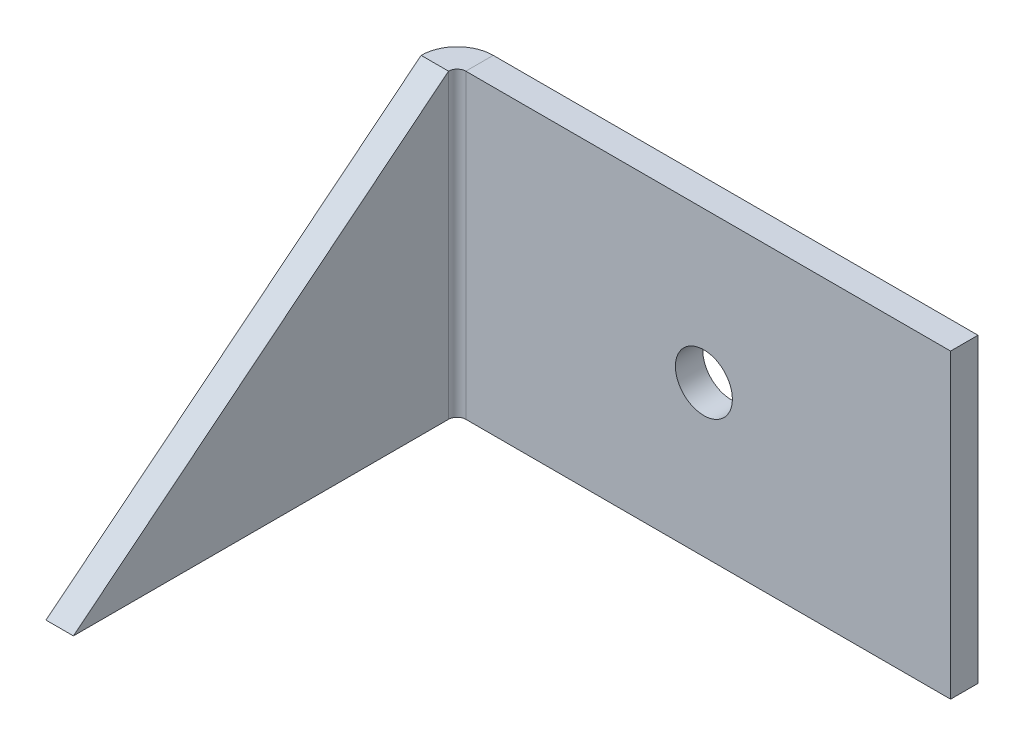
ISO-10303-21;
HEADER;
FILE_DESCRIPTION(('STEP AP214'),'2;1');
FILE_NAME('part.step','',(''),(''),'','','');
FILE_SCHEMA(('AUTOMOTIVE_DESIGN { 1 0 10303 214 1 1 1 1 }'));
ENDSEC;
DATA;
#1=APPLICATION_CONTEXT('core data for automotive mechanical design processes');
#2=APPLICATION_PROTOCOL_DEFINITION('international standard','automotive_design',2000,#1);
#3=PRODUCT_CONTEXT('',#1,'mechanical');
#4=PRODUCT('Part','Part','',(#3));
#5=PRODUCT_RELATED_PRODUCT_CATEGORY('part','',(#4));
#6=PRODUCT_DEFINITION_FORMATION('','',#4);
#7=PRODUCT_DEFINITION_CONTEXT('part definition',#1,'design');
#8=PRODUCT_DEFINITION('design','',#6,#7);
#9=PRODUCT_DEFINITION_SHAPE('','',#8);
#10=(LENGTH_UNIT() NAMED_UNIT(*) SI_UNIT(.MILLI.,.METRE.));
#11=(NAMED_UNIT(*) PLANE_ANGLE_UNIT() SI_UNIT($,.RADIAN.));
#12=(NAMED_UNIT(*) SI_UNIT($,.STERADIAN.) SOLID_ANGLE_UNIT());
#13=UNCERTAINTY_MEASURE_WITH_UNIT(LENGTH_MEASURE(1.E-05),#10,'distance_accuracy_value','');
#14=(GEOMETRIC_REPRESENTATION_CONTEXT(3) GLOBAL_UNCERTAINTY_ASSIGNED_CONTEXT((#13)) GLOBAL_UNIT_ASSIGNED_CONTEXT((#10,
#11,#12)) REPRESENTATION_CONTEXT('',''));
#15=CARTESIAN_POINT('',(0.,0.,0.));
#16=DIRECTION('',(0.,0.,1.));
#17=DIRECTION('',(1.,0.,0.));
#18=AXIS2_PLACEMENT_3D('',#15,#16,#17);
#19=CARTESIAN_POINT('',(-28.575,17.4625,3.175));
#20=DIRECTION('',(0.,-1.,0.));
#21=DIRECTION('',(0.,0.,-1.));
#22=AXIS2_PLACEMENT_3D('',#19,#20,#21);
#23=PLANE('',#22);
#24=DIRECTION('',(0.,0.,-1.));
#25=VECTOR('',#24,1.);
#26=CARTESIAN_POINT('',(-27.575,17.4625,3.175));
#27=LINE('',#26,#25);
#28=CARTESIAN_POINT('',(-27.575,17.4625,3.175));
#29=VERTEX_POINT('',#28);
#30=CARTESIAN_POINT('',(-27.575,17.4625,0.));
#31=VERTEX_POINT('',#30);
#32=EDGE_CURVE('E63',#29,#31,#27,.T.);
#33=ORIENTED_EDGE('',*,*,#32,.F.);
#34=DIRECTION('',(-1.,0.,0.));
#35=VECTOR('',#34,1.);
#36=CARTESIAN_POINT('',(-28.575,17.4625,3.175));
#37=LINE('',#36,#35);
#38=CARTESIAN_POINT('',(28.575,17.4625,3.175));
#39=VERTEX_POINT('',#38);
#40=EDGE_CURVE('E159',#39,#29,#37,.T.);
#41=ORIENTED_EDGE('',*,*,#40,.F.);
#42=DIRECTION('',(0.,0.,-1.));
#43=VECTOR('',#42,1.);
#44=CARTESIAN_POINT('',(28.575,17.4625,3.175));
#45=LINE('',#44,#43);
#46=CARTESIAN_POINT('',(28.575,17.4625,0.));
#47=VERTEX_POINT('',#46);
#48=EDGE_CURVE('E11',#39,#47,#45,.T.);
#49=ORIENTED_EDGE('',*,*,#48,.T.);
#50=DIRECTION('',(-1.,0.,0.));
#51=VECTOR('',#50,1.);
#52=CARTESIAN_POINT('',(-28.575,17.4625,0.));
#53=LINE('',#52,#51);
#54=EDGE_CURVE('E166',#47,#31,#53,.T.);
#55=ORIENTED_EDGE('',*,*,#54,.T.);
#56=EDGE_LOOP('',(#33,#41,#49,#55));
#57=FACE_BOUND('',#56,.T.);
#58=ADVANCED_FACE('F40',(#57),#23,.F.);
#59=CARTESIAN_POINT('',(-28.575,-17.4625,3.175));
#60=DIRECTION('',(0.,1.,0.));
#61=DIRECTION('',(0.,0.,1.));
#62=AXIS2_PLACEMENT_3D('',#59,#60,#61);
#63=PLANE('',#62);
#64=DIRECTION('',(0.,0.,-1.));
#65=VECTOR('',#64,1.);
#66=CARTESIAN_POINT('',(-27.575,-17.4625,3.175));
#67=LINE('',#66,#65);
#68=CARTESIAN_POINT('',(-27.575,-17.4625,3.175));
#69=VERTEX_POINT('',#68);
#70=CARTESIAN_POINT('',(-27.575,-17.4625,0.));
#71=VERTEX_POINT('',#70);
#72=EDGE_CURVE('E133',#69,#71,#67,.T.);
#73=ORIENTED_EDGE('',*,*,#72,.T.);
#74=DIRECTION('',(1.,0.,0.));
#75=VECTOR('',#74,1.);
#76=CARTESIAN_POINT('',(-28.575,-17.4625,0.));
#77=LINE('',#76,#75);
#78=CARTESIAN_POINT('',(28.575,-17.4625,0.));
#79=VERTEX_POINT('',#78);
#80=EDGE_CURVE('E160',#71,#79,#77,.T.);
#81=ORIENTED_EDGE('',*,*,#80,.T.);
#82=DIRECTION('',(0.,0.,-1.));
#83=VECTOR('',#82,1.);
#84=CARTESIAN_POINT('',(28.575,-17.4625,3.175));
#85=LINE('',#84,#83);
#86=CARTESIAN_POINT('',(28.575,-17.4625,3.175));
#87=VERTEX_POINT('',#86);
#88=EDGE_CURVE('E48',#87,#79,#85,.T.);
#89=ORIENTED_EDGE('',*,*,#88,.F.);
#90=DIRECTION('',(1.,0.,0.));
#91=VECTOR('',#90,1.);
#92=CARTESIAN_POINT('',(-28.575,-17.4625,3.175));
#93=LINE('',#92,#91);
#94=EDGE_CURVE('E162',#69,#87,#93,.T.);
#95=ORIENTED_EDGE('',*,*,#94,.F.);
#96=EDGE_LOOP('',(#73,#81,#89,#95));
#97=FACE_BOUND('',#96,.T.);
#98=ADVANCED_FACE('F180',(#97),#63,.F.);
#99=CARTESIAN_POINT('',(0.,0.,3.175));
#100=DIRECTION('',(0.,0.,1.));
#101=DIRECTION('',(1.,0.,0.));
#102=AXIS2_PLACEMENT_3D('',#99,#100,#101);
#103=PLANE('',#102);
#104=CARTESIAN_POINT('',(0.,0.,3.175));
#105=DIRECTION('',(0.,0.,1.));
#106=DIRECTION('',(1.,0.,0.));
#107=AXIS2_PLACEMENT_3D('',#104,#105,#106);
#108=CIRCLE('',#107,3.29999999999999);
#109=CARTESIAN_POINT('',(3.29999999999999,0.,3.175));
#110=VERTEX_POINT('',#109);
#111=EDGE_CURVE('E148',#110,#110,#108,.T.);
#112=ORIENTED_EDGE('',*,*,#111,.F.);
#113=EDGE_LOOP('',(#112));
#114=FACE_BOUND('',#113,.T.);
#115=ORIENTED_EDGE('',*,*,#40,.T.);
#116=DIRECTION('',(0.,-1.,0.));
#117=VECTOR('',#116,1.);
#118=CARTESIAN_POINT('',(-27.575,-17.4625,3.175));
#119=LINE('',#118,#117);
#120=EDGE_CURVE('E55',#69,#29,#119,.F.);
#121=ORIENTED_EDGE('',*,*,#120,.F.);
#122=ORIENTED_EDGE('',*,*,#94,.T.);
#123=DIRECTION('',(0.,1.,0.));
#124=VECTOR('',#123,1.);
#125=CARTESIAN_POINT('',(28.575,17.4625,3.175));
#126=LINE('',#125,#124);
#127=EDGE_CURVE('E156',#87,#39,#126,.T.);
#128=ORIENTED_EDGE('',*,*,#127,.T.);
#129=EDGE_LOOP('',(#115,#121,#122,#128));
#130=FACE_BOUND('',#129,.T.);
#131=ADVANCED_FACE('F178',(#114,#130),#103,.T.);
#132=CARTESIAN_POINT('',(0.,0.,0.));
#133=DIRECTION('',(0.,0.,1.));
#134=DIRECTION('',(1.,0.,0.));
#135=AXIS2_PLACEMENT_3D('',#132,#133,#134);
#136=PLANE('',#135);
#137=CARTESIAN_POINT('',(0.,0.,0.));
#138=DIRECTION('',(0.,0.,1.));
#139=DIRECTION('',(1.,0.,0.));
#140=AXIS2_PLACEMENT_3D('',#137,#138,#139);
#141=CIRCLE('',#140,3.3);
#142=CARTESIAN_POINT('',(3.3,0.,0.));
#143=VERTEX_POINT('',#142);
#144=EDGE_CURVE('E152',#143,#143,#141,.T.);
#145=ORIENTED_EDGE('',*,*,#144,.T.);
#146=EDGE_LOOP('',(#145));
#147=FACE_BOUND('',#146,.T.);
#148=DIRECTION('',(0.,-1.,0.));
#149=VECTOR('',#148,1.);
#150=CARTESIAN_POINT('',(-27.575,-17.4625,0.));
#151=LINE('',#150,#149);
#152=EDGE_CURVE('E134',#71,#31,#151,.F.);
#153=ORIENTED_EDGE('',*,*,#152,.T.);
#154=ORIENTED_EDGE('',*,*,#54,.F.);
#155=DIRECTION('',(0.,1.,0.));
#156=VECTOR('',#155,1.);
#157=CARTESIAN_POINT('',(28.575,17.4625,0.));
#158=LINE('',#157,#156);
#159=EDGE_CURVE('E155',#79,#47,#158,.T.);
#160=ORIENTED_EDGE('',*,*,#159,.F.);
#161=ORIENTED_EDGE('',*,*,#80,.F.);
#162=EDGE_LOOP('',(#153,#154,#160,#161));
#163=FACE_BOUND('',#162,.T.);
#164=ADVANCED_FACE('F177',(#147,#163),#136,.F.);
#165=CARTESIAN_POINT('',(28.575,17.4625,3.175));
#166=DIRECTION('',(-1.,0.,0.));
#167=DIRECTION('',(0.,-1.,0.));
#168=AXIS2_PLACEMENT_3D('',#165,#166,#167);
#169=PLANE('',#168);
#170=ORIENTED_EDGE('',*,*,#159,.T.);
#171=ORIENTED_EDGE('',*,*,#48,.F.);
#172=ORIENTED_EDGE('',*,*,#127,.F.);
#173=ORIENTED_EDGE('',*,*,#88,.T.);
#174=EDGE_LOOP('',(#170,#171,#172,#173));
#175=FACE_BOUND('',#174,.T.);
#176=ADVANCED_FACE('F42',(#175),#169,.F.);
#177=CARTESIAN_POINT('',(0.,0.,3.175));
#178=DIRECTION('',(0.,0.,1.));
#179=DIRECTION('',(1.,0.,0.));
#180=AXIS2_PLACEMENT_3D('',#177,#178,#179);
#181=CYLINDRICAL_SURFACE('',#180,3.29999999999999);
#182=ORIENTED_EDGE('',*,*,#144,.F.);
#183=EDGE_LOOP('',(#182));
#184=FACE_BOUND('',#183,.T.);
#185=ORIENTED_EDGE('',*,*,#111,.T.);
#186=EDGE_LOOP('',(#185));
#187=FACE_BOUND('',#186,.T.);
#188=ADVANCED_FACE('F221',(#184,#187),#181,.F.);
#189=CARTESIAN_POINT('',(-27.575,17.4625,4.17500000000001));
#190=DIRECTION('',(0.,1.,0.));
#191=DIRECTION('',(0.,0.,1.));
#192=AXIS2_PLACEMENT_3D('',#189,#190,#191);
#193=PLANE('',#192);
#194=DIRECTION('',(-1.,0.,0.));
#195=VECTOR('',#194,1.);
#196=CARTESIAN_POINT('',(-28.575,17.4625,4.175));
#197=LINE('',#196,#195);
#198=CARTESIAN_POINT('',(-28.5750000000001,17.4625,4.175));
#199=VERTEX_POINT('',#198);
#200=CARTESIAN_POINT('',(-31.75,17.4625,4.17499999999999));
#201=VERTEX_POINT('',#200);
#202=EDGE_CURVE('E99',#199,#201,#197,.T.);
#203=ORIENTED_EDGE('',*,*,#202,.F.);
#204=CARTESIAN_POINT('',(-27.575,17.4625,4.17500000000001));
#205=DIRECTION('',(0.,-1.,0.));
#206=DIRECTION('',(0.,0.,-1.));
#207=AXIS2_PLACEMENT_3D('',#204,#205,#206);
#208=CIRCLE('',#207,1.);
#209=EDGE_CURVE('E141',#29,#199,#208,.F.);
#210=ORIENTED_EDGE('',*,*,#209,.F.);
#211=ORIENTED_EDGE('',*,*,#32,.T.);
#212=CARTESIAN_POINT('',(-27.575,17.4625,4.17500000000001));
#213=DIRECTION('',(0.,-1.,0.));
#214=DIRECTION('',(0.,0.,-1.));
#215=AXIS2_PLACEMENT_3D('',#212,#213,#214);
#216=CIRCLE('',#215,4.175);
#217=EDGE_CURVE('E125',#31,#201,#216,.F.);
#218=ORIENTED_EDGE('',*,*,#217,.T.);
#219=EDGE_LOOP('',(#203,#210,#211,#218));
#220=FACE_BOUND('',#219,.T.);
#221=ADVANCED_FACE('F132',(#220),#193,.T.);
#222=CARTESIAN_POINT('',(-27.575,-17.4625,4.17500000000001));
#223=DIRECTION('',(0.,1.,0.));
#224=DIRECTION('',(0.,0.,1.));
#225=AXIS2_PLACEMENT_3D('',#222,#223,#224);
#226=PLANE('',#225);
#227=CARTESIAN_POINT('',(-27.575,-17.4625,4.17500000000001));
#228=DIRECTION('',(0.,-1.,0.));
#229=DIRECTION('',(0.,0.,-1.));
#230=AXIS2_PLACEMENT_3D('',#227,#228,#229);
#231=CIRCLE('',#230,1.);
#232=CARTESIAN_POINT('',(-28.575,-17.4625,4.175));
#233=VERTEX_POINT('',#232);
#234=EDGE_CURVE('E144',#233,#69,#231,.T.);
#235=ORIENTED_EDGE('',*,*,#234,.F.);
#236=DIRECTION('',(-1.,0.,0.));
#237=VECTOR('',#236,1.);
#238=CARTESIAN_POINT('',(-28.575,-17.4625,4.175));
#239=LINE('',#238,#237);
#240=CARTESIAN_POINT('',(-31.75,-17.4625,4.17499999999999));
#241=VERTEX_POINT('',#240);
#242=EDGE_CURVE('E130',#233,#241,#239,.T.);
#243=ORIENTED_EDGE('',*,*,#242,.T.);
#244=CARTESIAN_POINT('',(-27.575,-17.4625,4.17500000000001));
#245=DIRECTION('',(0.,-1.,0.));
#246=DIRECTION('',(0.,0.,-1.));
#247=AXIS2_PLACEMENT_3D('',#244,#245,#246);
#248=CIRCLE('',#247,4.175);
#249=EDGE_CURVE('E127',#241,#71,#248,.T.);
#250=ORIENTED_EDGE('',*,*,#249,.T.);
#251=ORIENTED_EDGE('',*,*,#72,.F.);
#252=EDGE_LOOP('',(#235,#243,#250,#251));
#253=FACE_BOUND('',#252,.T.);
#254=ADVANCED_FACE('F183',(#253),#226,.F.);
#255=CARTESIAN_POINT('',(-27.575,-17.4625,4.17500000000001));
#256=DIRECTION('',(0.,-1.,0.));
#257=DIRECTION('',(-1.,0.,0.));
#258=AXIS2_PLACEMENT_3D('',#255,#256,#257);
#259=CYLINDRICAL_SURFACE('',#258,4.175);
#260=ORIENTED_EDGE('',*,*,#152,.F.);
#261=ORIENTED_EDGE('',*,*,#249,.F.);
#262=DIRECTION('',(0.,1.,0.));
#263=VECTOR('',#262,1.);
#264=CARTESIAN_POINT('',(-31.75,0.,4.17499999999999));
#265=LINE('',#264,#263);
#266=EDGE_CURVE('E116',#241,#201,#265,.T.);
#267=ORIENTED_EDGE('',*,*,#266,.T.);
#268=ORIENTED_EDGE('',*,*,#217,.F.);
#269=EDGE_LOOP('',(#260,#261,#267,#268));
#270=FACE_BOUND('',#269,.T.);
#271=ADVANCED_FACE('F124',(#270),#259,.T.);
#272=CARTESIAN_POINT('',(-27.575,-17.4625,4.17500000000001));
#273=DIRECTION('',(0.,-1.,0.));
#274=DIRECTION('',(-1.,0.,0.));
#275=AXIS2_PLACEMENT_3D('',#272,#273,#274);
#276=CYLINDRICAL_SURFACE('',#275,1.);
#277=ORIENTED_EDGE('',*,*,#120,.T.);
#278=ORIENTED_EDGE('',*,*,#209,.T.);
#279=DIRECTION('',(0.,-1.,0.));
#280=VECTOR('',#279,1.);
#281=CARTESIAN_POINT('',(-28.575,17.4625,4.175));
#282=LINE('',#281,#280);
#283=EDGE_CURVE('E110',#199,#233,#282,.T.);
#284=ORIENTED_EDGE('',*,*,#283,.T.);
#285=ORIENTED_EDGE('',*,*,#234,.T.);
#286=EDGE_LOOP('',(#277,#278,#284,#285));
#287=FACE_BOUND('',#286,.T.);
#288=ADVANCED_FACE('F186',(#287),#276,.F.);
#289=CARTESIAN_POINT('',(-31.7500000000002,-17.4625,47.625));
#290=DIRECTION('',(0.,1.,0.));
#291=DIRECTION('',(-1.,0.,0.));
#292=AXIS2_PLACEMENT_3D('',#289,#290,#291);
#293=PLANE('',#292);
#294=ORIENTED_EDGE('',*,*,#242,.F.);
#295=DIRECTION('',(0.,0.,1.));
#296=VECTOR('',#295,1.);
#297=CARTESIAN_POINT('',(-28.5750000000002,-17.4625,47.625));
#298=LINE('',#297,#296);
#299=CARTESIAN_POINT('',(-28.5750000000001,-17.4625,47.625));
#300=VERTEX_POINT('',#299);
#301=EDGE_CURVE('E129',#233,#300,#298,.T.);
#302=ORIENTED_EDGE('',*,*,#301,.T.);
#303=DIRECTION('',(1.,0.,0.));
#304=VECTOR('',#303,1.);
#305=CARTESIAN_POINT('',(-31.7500000000002,-17.4625,47.625));
#306=LINE('',#305,#304);
#307=CARTESIAN_POINT('',(-31.7500000000002,-17.4625,47.625));
#308=VERTEX_POINT('',#307);
#309=EDGE_CURVE('E147',#308,#300,#306,.T.);
#310=ORIENTED_EDGE('',*,*,#309,.F.);
#311=DIRECTION('',(0.,0.,1.));
#312=VECTOR('',#311,1.);
#313=CARTESIAN_POINT('',(-31.7500000000002,-17.4625,47.625));
#314=LINE('',#313,#312);
#315=EDGE_CURVE('E118',#241,#308,#314,.T.);
#316=ORIENTED_EDGE('',*,*,#315,.F.);
#317=EDGE_LOOP('',(#294,#302,#310,#316));
#318=FACE_BOUND('',#317,.T.);
#319=ADVANCED_FACE('F198',(#318),#293,.F.);
#320=CARTESIAN_POINT('',(-31.75,0.,-1.09221238463229E-13));
#321=DIRECTION('',(1.,0.,0.));
#322=DIRECTION('',(0.,0.,-1.));
#323=AXIS2_PLACEMENT_3D('',#320,#321,#322);
#324=PLANE('',#323);
#325=ORIENTED_EDGE('',*,*,#315,.T.);
#326=DIRECTION('',(0.,-0.626498155753381,0.77942290243334));
#327=VECTOR('',#326,1.);
#328=CARTESIAN_POINT('',(-31.75,12.6471515829947,10.1657484243058));
#329=LINE('',#328,#327);
#330=EDGE_CURVE('E102',#201,#308,#329,.T.);
#331=ORIENTED_EDGE('',*,*,#330,.F.);
#332=ORIENTED_EDGE('',*,*,#266,.F.);
#333=EDGE_LOOP('',(#325,#331,#332));
#334=FACE_BOUND('',#333,.T.);
#335=ADVANCED_FACE('F115',(#334),#324,.F.);
#336=CARTESIAN_POINT('',(-28.575,0.,0.));
#337=DIRECTION('',(1.,0.,0.));
#338=DIRECTION('',(0.,0.,-1.));
#339=AXIS2_PLACEMENT_3D('',#336,#337,#338);
#340=PLANE('',#339);
#341=DIRECTION('',(0.,0.626498155753381,-0.77942290243334));
#342=VECTOR('',#341,1.);
#343=CARTESIAN_POINT('',(-28.575,12.6471515829947,10.1657484243058));
#344=LINE('',#343,#342);
#345=EDGE_CURVE('E105',#300,#199,#344,.T.);
#346=ORIENTED_EDGE('',*,*,#345,.F.);
#347=ORIENTED_EDGE('',*,*,#301,.F.);
#348=ORIENTED_EDGE('',*,*,#283,.F.);
#349=EDGE_LOOP('',(#346,#347,#348));
#350=FACE_BOUND('',#349,.T.);
#351=ADVANCED_FACE('F197',(#350),#340,.T.);
#352=CARTESIAN_POINT('',(28.5750000000001,12.6471515829947,10.165748424306));
#353=DIRECTION('',(0.,-0.77942290243334,-0.626498155753381));
#354=DIRECTION('',(0.,0.626498155753381,-0.77942290243334));
#355=AXIS2_PLACEMENT_3D('',#352,#353,#354);
#356=PLANE('',#355);
#357=ORIENTED_EDGE('',*,*,#345,.T.);
#358=ORIENTED_EDGE('',*,*,#202,.T.);
#359=ORIENTED_EDGE('',*,*,#330,.T.);
#360=ORIENTED_EDGE('',*,*,#309,.T.);
#361=EDGE_LOOP('',(#357,#358,#359,#360));
#362=FACE_BOUND('',#361,.T.);
#363=ADVANCED_FACE('F101',(#362),#356,.F.);
#364=CLOSED_SHELL('',(#58,#98,#131,#164,#176,#188,#221,#254,#271,#288,#319,#335,#351,#363));
#365=MANIFOLD_SOLID_BREP('B2',#364);
#366=ADVANCED_BREP_SHAPE_REPRESENTATION('',(#18,#365),#14);
#367=SHAPE_DEFINITION_REPRESENTATION(#9,#366);
ENDSEC;
END-ISO-10303-21;
